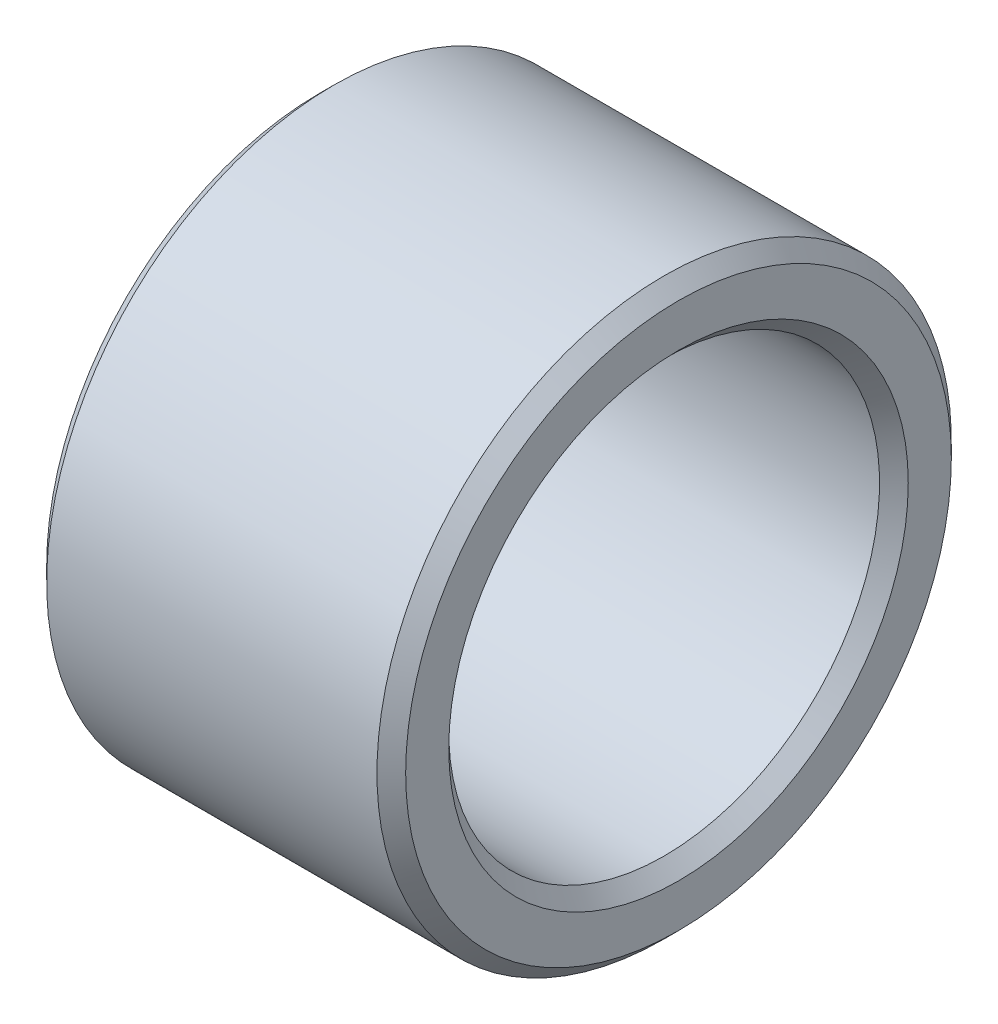
ISO-10303-21;
HEADER;
FILE_DESCRIPTION(('STEP AP214'),'2;1');
FILE_NAME('part.step','',(''),(''),'','','');
FILE_SCHEMA(('AUTOMOTIVE_DESIGN { 1 0 10303 214 1 1 1 1 }'));
ENDSEC;
DATA;
#1=APPLICATION_CONTEXT('core data for automotive mechanical design processes');
#2=APPLICATION_PROTOCOL_DEFINITION('international standard','automotive_design',2000,#1);
#3=PRODUCT_CONTEXT('',#1,'mechanical');
#4=PRODUCT('Part','Part','',(#3));
#5=PRODUCT_RELATED_PRODUCT_CATEGORY('part','',(#4));
#6=PRODUCT_DEFINITION_FORMATION('','',#4);
#7=PRODUCT_DEFINITION_CONTEXT('part definition',#1,'design');
#8=PRODUCT_DEFINITION('design','',#6,#7);
#9=PRODUCT_DEFINITION_SHAPE('','',#8);
#10=(LENGTH_UNIT() NAMED_UNIT(*) SI_UNIT(.MILLI.,.METRE.));
#11=(NAMED_UNIT(*) PLANE_ANGLE_UNIT() SI_UNIT($,.RADIAN.));
#12=(NAMED_UNIT(*) SI_UNIT($,.STERADIAN.) SOLID_ANGLE_UNIT());
#13=UNCERTAINTY_MEASURE_WITH_UNIT(LENGTH_MEASURE(1.E-05),#10,'distance_accuracy_value','');
#14=(GEOMETRIC_REPRESENTATION_CONTEXT(3) GLOBAL_UNCERTAINTY_ASSIGNED_CONTEXT((#13)) GLOBAL_UNIT_ASSIGNED_CONTEXT((#10,
#11,#12)) REPRESENTATION_CONTEXT('',''));
#15=CARTESIAN_POINT('',(0.,0.,0.));
#16=DIRECTION('',(0.,0.,1.));
#17=DIRECTION('',(1.,0.,0.));
#18=AXIS2_PLACEMENT_3D('',#15,#16,#17);
#19=CARTESIAN_POINT('',(-3.,0.,0.));
#20=DIRECTION('',(-1.,0.,0.));
#21=DIRECTION('',(0.,-1.,0.));
#22=AXIS2_PLACEMENT_3D('',#19,#20,#21);
#23=CYLINDRICAL_SURFACE('',#22,3.);
#24=CARTESIAN_POINT('',(4.8,0.,0.));
#25=DIRECTION('',(-1.,0.,0.));
#26=DIRECTION('',(0.,-1.,0.));
#27=AXIS2_PLACEMENT_3D('',#24,#25,#26);
#28=CIRCLE('',#27,3.);
#29=CARTESIAN_POINT('',(4.8,-3.,0.));
#30=VERTEX_POINT('',#29);
#31=EDGE_CURVE('E10',#30,#30,#28,.T.);
#32=ORIENTED_EDGE('',*,*,#31,.F.);
#33=EDGE_LOOP('',(#32));
#34=FACE_BOUND('',#33,.T.);
#35=CARTESIAN_POINT('',(0.2,0.,0.));
#36=DIRECTION('',(-1.,0.,0.));
#37=DIRECTION('',(0.,-1.,0.));
#38=AXIS2_PLACEMENT_3D('',#35,#36,#37);
#39=CIRCLE('',#38,3.);
#40=CARTESIAN_POINT('',(0.2,-3.,0.));
#41=VERTEX_POINT('',#40);
#42=EDGE_CURVE('E69',#41,#41,#39,.T.);
#43=ORIENTED_EDGE('',*,*,#42,.T.);
#44=EDGE_LOOP('',(#43));
#45=FACE_BOUND('',#44,.T.);
#46=ADVANCED_FACE('F16',(#34,#45),#23,.F.);
#47=CARTESIAN_POINT('',(5.,0.,0.));
#48=DIRECTION('',(1.,0.,0.));
#49=DIRECTION('',(0.,1.,0.));
#50=AXIS2_PLACEMENT_3D('',#47,#48,#49);
#51=CONICAL_SURFACE('',#50,3.2,0.785398163397447);
#52=CARTESIAN_POINT('',(5.,0.,0.));
#53=DIRECTION('',(-1.,0.,0.));
#54=DIRECTION('',(0.,-1.,0.));
#55=AXIS2_PLACEMENT_3D('',#52,#53,#54);
#56=CIRCLE('',#55,3.2);
#57=CARTESIAN_POINT('',(5.,-3.2,0.));
#58=VERTEX_POINT('',#57);
#59=EDGE_CURVE('E24',#58,#58,#56,.T.);
#60=ORIENTED_EDGE('',*,*,#59,.F.);
#61=EDGE_LOOP('',(#60));
#62=FACE_BOUND('',#61,.T.);
#63=ORIENTED_EDGE('',*,*,#31,.T.);
#64=EDGE_LOOP('',(#63));
#65=FACE_BOUND('',#64,.T.);
#66=ADVANCED_FACE('F119',(#62,#65),#51,.F.);
#67=CARTESIAN_POINT('',(5.,-3.8,0.));
#68=DIRECTION('',(1.,0.,0.));
#69=DIRECTION('',(0.,1.,0.));
#70=AXIS2_PLACEMENT_3D('',#67,#68,#69);
#71=PLANE('',#70);
#72=CARTESIAN_POINT('',(5.,0.,0.));
#73=DIRECTION('',(-1.,0.,0.));
#74=DIRECTION('',(0.,-1.,0.));
#75=AXIS2_PLACEMENT_3D('',#72,#73,#74);
#76=CIRCLE('',#75,3.8);
#77=CARTESIAN_POINT('',(5.,-3.8,0.));
#78=VERTEX_POINT('',#77);
#79=EDGE_CURVE('E86',#78,#78,#76,.T.);
#80=ORIENTED_EDGE('',*,*,#79,.F.);
#81=EDGE_LOOP('',(#80));
#82=FACE_BOUND('',#81,.T.);
#83=ORIENTED_EDGE('',*,*,#59,.T.);
#84=EDGE_LOOP('',(#83));
#85=FACE_BOUND('',#84,.T.);
#86=ADVANCED_FACE('F124',(#82,#85),#71,.T.);
#87=CARTESIAN_POINT('',(4.8,0.,0.));
#88=DIRECTION('',(-1.,0.,0.));
#89=DIRECTION('',(0.,-1.,0.));
#90=AXIS2_PLACEMENT_3D('',#87,#88,#89);
#91=CONICAL_SURFACE('',#90,4.,0.785398163397445);
#92=CARTESIAN_POINT('',(4.8,0.,0.));
#93=DIRECTION('',(-1.,0.,0.));
#94=DIRECTION('',(0.,-1.,0.));
#95=AXIS2_PLACEMENT_3D('',#92,#93,#94);
#96=CIRCLE('',#95,4.);
#97=CARTESIAN_POINT('',(4.8,-4.,0.));
#98=VERTEX_POINT('',#97);
#99=EDGE_CURVE('E83',#98,#98,#96,.T.);
#100=ORIENTED_EDGE('',*,*,#99,.F.);
#101=EDGE_LOOP('',(#100));
#102=FACE_BOUND('',#101,.T.);
#103=ORIENTED_EDGE('',*,*,#79,.T.);
#104=EDGE_LOOP('',(#103));
#105=FACE_BOUND('',#104,.T.);
#106=ADVANCED_FACE('F128',(#102,#105),#91,.T.);
#107=CARTESIAN_POINT('',(-3.,0.,0.));
#108=DIRECTION('',(-1.,0.,0.));
#109=DIRECTION('',(0.,-1.,0.));
#110=AXIS2_PLACEMENT_3D('',#107,#108,#109);
#111=CYLINDRICAL_SURFACE('',#110,4.);
#112=CARTESIAN_POINT('',(0.2,0.,0.));
#113=DIRECTION('',(-1.,0.,0.));
#114=DIRECTION('',(0.,-1.,0.));
#115=AXIS2_PLACEMENT_3D('',#112,#113,#114);
#116=CIRCLE('',#115,4.);
#117=CARTESIAN_POINT('',(0.2,-4.,0.));
#118=VERTEX_POINT('',#117);
#119=EDGE_CURVE('E80',#118,#118,#116,.T.);
#120=ORIENTED_EDGE('',*,*,#119,.F.);
#121=EDGE_LOOP('',(#120));
#122=FACE_BOUND('',#121,.T.);
#123=ORIENTED_EDGE('',*,*,#99,.T.);
#124=EDGE_LOOP('',(#123));
#125=FACE_BOUND('',#124,.T.);
#126=ADVANCED_FACE('F144',(#122,#125),#111,.T.);
#127=CARTESIAN_POINT('',(0.,0.,0.));
#128=DIRECTION('',(1.,0.,0.));
#129=DIRECTION('',(0.,1.,0.));
#130=AXIS2_PLACEMENT_3D('',#127,#128,#129);
#131=CONICAL_SURFACE('',#130,3.8,0.785398163397449);
#132=CARTESIAN_POINT('',(0.,0.,0.));
#133=DIRECTION('',(-1.,0.,0.));
#134=DIRECTION('',(0.,-1.,0.));
#135=AXIS2_PLACEMENT_3D('',#132,#133,#134);
#136=CIRCLE('',#135,3.8);
#137=CARTESIAN_POINT('',(0.,-3.8,0.));
#138=VERTEX_POINT('',#137);
#139=EDGE_CURVE('E75',#138,#138,#136,.T.);
#140=ORIENTED_EDGE('',*,*,#139,.F.);
#141=EDGE_LOOP('',(#140));
#142=FACE_BOUND('',#141,.T.);
#143=ORIENTED_EDGE('',*,*,#119,.T.);
#144=EDGE_LOOP('',(#143));
#145=FACE_BOUND('',#144,.T.);
#146=ADVANCED_FACE('F153',(#142,#145),#131,.T.);
#147=CARTESIAN_POINT('',(0.,-3.2,0.));
#148=DIRECTION('',(-1.,0.,0.));
#149=DIRECTION('',(0.,1.,0.));
#150=AXIS2_PLACEMENT_3D('',#147,#148,#149);
#151=PLANE('',#150);
#152=CARTESIAN_POINT('',(0.,0.,0.));
#153=DIRECTION('',(-1.,0.,0.));
#154=DIRECTION('',(0.,-1.,0.));
#155=AXIS2_PLACEMENT_3D('',#152,#153,#154);
#156=CIRCLE('',#155,3.2);
#157=CARTESIAN_POINT('',(0.,-3.2,0.));
#158=VERTEX_POINT('',#157);
#159=EDGE_CURVE('E65',#158,#158,#156,.T.);
#160=ORIENTED_EDGE('',*,*,#159,.F.);
#161=EDGE_LOOP('',(#160));
#162=FACE_BOUND('',#161,.T.);
#163=ORIENTED_EDGE('',*,*,#139,.T.);
#164=EDGE_LOOP('',(#163));
#165=FACE_BOUND('',#164,.T.);
#166=ADVANCED_FACE('F162',(#162,#165),#151,.T.);
#167=CARTESIAN_POINT('',(0.2,0.,0.));
#168=DIRECTION('',(-1.,0.,0.));
#169=DIRECTION('',(0.,-1.,0.));
#170=AXIS2_PLACEMENT_3D('',#167,#168,#169);
#171=CONICAL_SURFACE('',#170,3.,0.785398163397447);
#172=ORIENTED_EDGE('',*,*,#42,.F.);
#173=EDGE_LOOP('',(#172));
#174=FACE_BOUND('',#173,.T.);
#175=ORIENTED_EDGE('',*,*,#159,.T.);
#176=EDGE_LOOP('',(#175));
#177=FACE_BOUND('',#176,.T.);
#178=ADVANCED_FACE('F66',(#174,#177),#171,.F.);
#179=CLOSED_SHELL('',(#46,#66,#86,#106,#126,#146,#166,#178));
#180=MANIFOLD_SOLID_BREP('B1',#179);
#181=ADVANCED_BREP_SHAPE_REPRESENTATION('',(#18,#180),#14);
#182=SHAPE_DEFINITION_REPRESENTATION(#9,#181);
ENDSEC;
END-ISO-10303-21;
